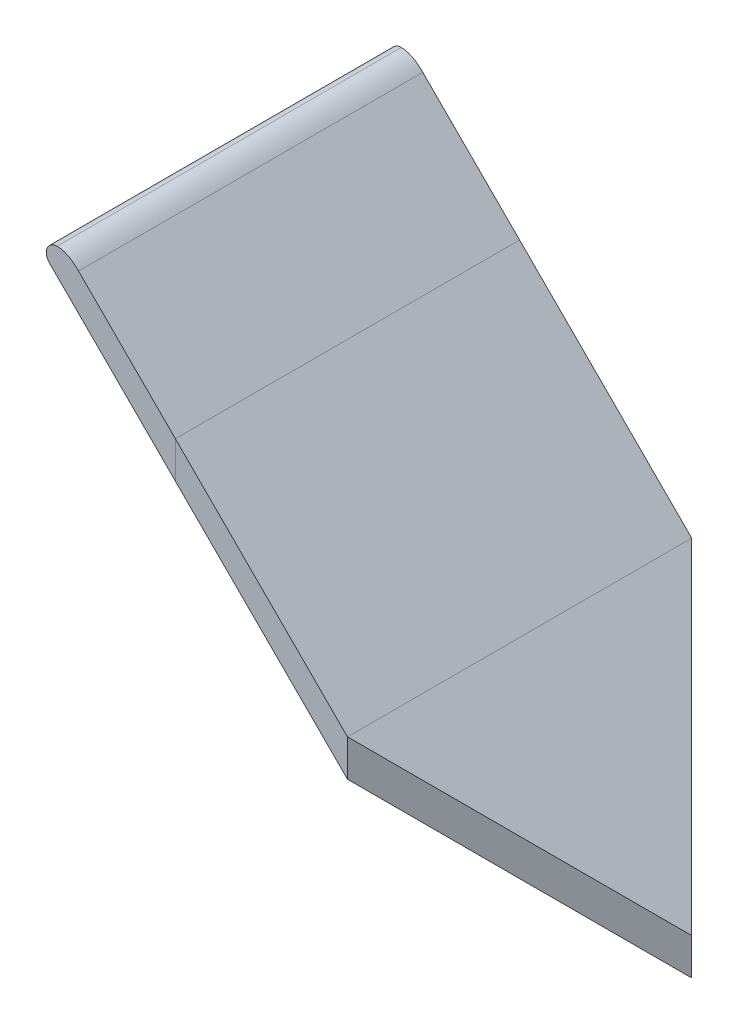
ISO-10303-21;
HEADER;
FILE_DESCRIPTION(('STEP AP214'),'2;1');
FILE_NAME('part.step','',(''),(''),'','','');
FILE_SCHEMA(('AUTOMOTIVE_DESIGN { 1 0 10303 214 1 1 1 1 }'));
ENDSEC;
DATA;
#1=APPLICATION_CONTEXT('core data for automotive mechanical design processes');
#2=APPLICATION_PROTOCOL_DEFINITION('international standard','automotive_design',2000,#1);
#3=PRODUCT_CONTEXT('',#1,'mechanical');
#4=PRODUCT('Part','Part','',(#3));
#5=PRODUCT_RELATED_PRODUCT_CATEGORY('part','',(#4));
#6=PRODUCT_DEFINITION_FORMATION('','',#4);
#7=PRODUCT_DEFINITION_CONTEXT('part definition',#1,'design');
#8=PRODUCT_DEFINITION('design','',#6,#7);
#9=PRODUCT_DEFINITION_SHAPE('','',#8);
#10=(LENGTH_UNIT() NAMED_UNIT(*) SI_UNIT(.MILLI.,.METRE.));
#11=(NAMED_UNIT(*) PLANE_ANGLE_UNIT() SI_UNIT($,.RADIAN.));
#12=(NAMED_UNIT(*) SI_UNIT($,.STERADIAN.) SOLID_ANGLE_UNIT());
#13=UNCERTAINTY_MEASURE_WITH_UNIT(LENGTH_MEASURE(1.E-05),#10,'distance_accuracy_value','');
#14=(GEOMETRIC_REPRESENTATION_CONTEXT(3) GLOBAL_UNCERTAINTY_ASSIGNED_CONTEXT((#13)) GLOBAL_UNIT_ASSIGNED_CONTEXT((#10,
#11,#12)) REPRESENTATION_CONTEXT('',''));
#15=CARTESIAN_POINT('',(0.,0.,0.));
#16=DIRECTION('',(0.,0.,1.));
#17=DIRECTION('',(1.,0.,0.));
#18=AXIS2_PLACEMENT_3D('',#15,#16,#17);
#19=CARTESIAN_POINT('',(-100.,0.,0.));
#20=DIRECTION('',(1.,0.,0.));
#21=DIRECTION('',(0.,0.,-1.));
#22=AXIS2_PLACEMENT_3D('',#19,#20,#21);
#23=PLANE('',#22);
#24=DIRECTION('',(0.,-1.,0.));
#25=VECTOR('',#24,1.);
#26=CARTESIAN_POINT('',(-100.,0.,100.));
#27=LINE('',#26,#25);
#28=CARTESIAN_POINT('',(-100.,-156.250000000004,100.));
#29=VERTEX_POINT('',#28);
#30=CARTESIAN_POINT('',(-100.,-177.588834764832,100.));
#31=VERTEX_POINT('',#30);
#32=EDGE_CURVE('E156',#29,#31,#27,.T.);
#33=ORIENTED_EDGE('',*,*,#32,.F.);
#34=DIRECTION('',(0.,0.,-1.));
#35=VECTOR('',#34,1.);
#36=CARTESIAN_POINT('',(-100.,-156.250000000004,-250.));
#37=LINE('',#36,#35);
#38=CARTESIAN_POINT('',(-100.,-156.250000000004,-99.9999999999999));
#39=VERTEX_POINT('',#38);
#40=EDGE_CURVE('E144',#29,#39,#37,.T.);
#41=ORIENTED_EDGE('',*,*,#40,.T.);
#42=DIRECTION('',(0.,-1.,0.));
#43=VECTOR('',#42,1.);
#44=CARTESIAN_POINT('',(-100.,0.,-100.));
#45=LINE('',#44,#43);
#46=CARTESIAN_POINT('',(-100.,-177.588834764832,-99.9999999999999));
#47=VERTEX_POINT('',#46);
#48=EDGE_CURVE('E83',#39,#47,#45,.T.);
#49=ORIENTED_EDGE('',*,*,#48,.T.);
#50=DIRECTION('',(0.,0.,-1.));
#51=VECTOR('',#50,1.);
#52=CARTESIAN_POINT('',(-100.,-177.588834764833,-250.));
#53=LINE('',#52,#51);
#54=EDGE_CURVE('E157',#31,#47,#53,.T.);
#55=ORIENTED_EDGE('',*,*,#54,.F.);
#56=EDGE_LOOP('',(#33,#41,#49,#55));
#57=FACE_BOUND('',#56,.T.);
#58=ADVANCED_FACE('F80',(#57),#23,.F.);
#59=CARTESIAN_POINT('',(-135.258883476484,-135.258883476483,0.));
#60=DIRECTION('',(0.707106781186548,0.707106781186547,0.));
#61=DIRECTION('',(-0.707106781186547,0.707106781186548,0.));
#62=AXIS2_PLACEMENT_3D('',#59,#60,#61);
#63=PLANE('',#62);
#64=DIRECTION('',(0.707106781186547,-0.707106781186548,0.));
#65=VECTOR('',#64,1.);
#66=CARTESIAN_POINT('',(-74.7005095501215,-195.817257402846,-25.));
#67=LINE('',#66,#65);
#68=CARTESIAN_POINT('',(-74.7005095501215,-195.817257402846,-25.));
#69=VERTEX_POINT('',#68);
#70=CARTESIAN_POINT('',(-57.0228400204579,-213.494926932509,-25.));
#71=VERTEX_POINT('',#70);
#72=EDGE_CURVE('E171',#69,#71,#67,.T.);
#73=ORIENTED_EDGE('',*,*,#72,.T.);
#74=DIRECTION('',(0.,0.,1.));
#75=VECTOR('',#74,1.);
#76=CARTESIAN_POINT('',(-57.0228400204579,-213.494926932509,25.0000000000001));
#77=LINE('',#76,#75);
#78=CARTESIAN_POINT('',(-57.0228400204579,-213.494926932509,25.0000000000001));
#79=VERTEX_POINT('',#78);
#80=EDGE_CURVE('E193',#71,#79,#77,.T.);
#81=ORIENTED_EDGE('',*,*,#80,.T.);
#82=DIRECTION('',(-0.707106781186546,0.707106781186549,0.));
#83=VECTOR('',#82,1.);
#84=CARTESIAN_POINT('',(-74.7005095501215,-195.817257402846,25.0000000000001));
#85=LINE('',#84,#83);
#86=CARTESIAN_POINT('',(-74.7005095501215,-195.817257402846,25.0000000000001));
#87=VERTEX_POINT('',#86);
#88=EDGE_CURVE('E191',#79,#87,#85,.T.);
#89=ORIENTED_EDGE('',*,*,#88,.T.);
#90=DIRECTION('',(0.,0.,-1.));
#91=VECTOR('',#90,1.);
#92=CARTESIAN_POINT('',(-74.7005095501215,-195.817257402846,25.0000000000001));
#93=LINE('',#92,#91);
#94=EDGE_CURVE('E181',#87,#69,#93,.T.);
#95=ORIENTED_EDGE('',*,*,#94,.T.);
#96=EDGE_LOOP('',(#73,#81,#89,#95));
#97=FACE_BOUND('',#96,.T.);
#98=ADVANCED_FACE('F197',(#97),#63,.F.);
#99=CARTESIAN_POINT('',(0.,0.,0.));
#100=DIRECTION('',(0.707106781186547,0.,-0.707106781186548));
#101=DIRECTION('',(-0.707106781186548,0.,-0.707106781186547));
#102=AXIS2_PLACEMENT_3D('',#99,#100,#101);
#103=PLANE('',#102);
#104=ORIENTED_EDGE('',*,*,#48,.F.);
#105=DIRECTION('',(-0.577350269189622,0.577350269189634,-0.577350269189622));
#106=VECTOR('',#105,1.);
#107=CARTESIAN_POINT('',(-258.333333333334,2.08333333333316,-258.333333333333));
#108=LINE('',#107,#106);
#109=CARTESIAN_POINT('',(-2.83661982791727E-11,-256.249999999977,2.8421709430404E-11));
#110=VERTEX_POINT('',#109);
#111=EDGE_CURVE('E151',#110,#39,#108,.T.);
#112=ORIENTED_EDGE('',*,*,#111,.F.);
#113=DIRECTION('',(0.,-1.,0.));
#114=VECTOR('',#113,1.);
#115=CARTESIAN_POINT('',(0.,0.,0.));
#116=LINE('',#115,#114);
#117=CARTESIAN_POINT('',(-2.83939538547884E-11,-277.588834764804,2.8421709430404E-11));
#118=VERTEX_POINT('',#117);
#119=EDGE_CURVE('E163',#110,#118,#116,.T.);
#120=ORIENTED_EDGE('',*,*,#119,.T.);
#121=DIRECTION('',(-0.577350269189625,0.577350269189627,-0.577350269189625));
#122=VECTOR('',#121,1.);
#123=CARTESIAN_POINT('',(-29.7440178594283,-247.844816905404,-29.7440178594283));
#124=LINE('',#123,#122);
#125=EDGE_CURVE('E164',#118,#47,#124,.T.);
#126=ORIENTED_EDGE('',*,*,#125,.T.);
#127=EDGE_LOOP('',(#104,#112,#120,#126));
#128=FACE_BOUND('',#127,.T.);
#129=ADVANCED_FACE('F219',(#128),#103,.T.);
#130=CARTESIAN_POINT('',(0.,0.,0.));
#131=DIRECTION('',(-0.707106781186548,0.,-0.707106781186547));
#132=DIRECTION('',(-0.707106781186547,0.,0.707106781186548));
#133=AXIS2_PLACEMENT_3D('',#130,#131,#132);
#134=PLANE('',#133);
#135=DIRECTION('',(-0.577350269189622,0.577350269189634,0.577350269189622));
#136=VECTOR('',#135,1.);
#137=CARTESIAN_POINT('',(-91.6666666666691,-164.583333333335,91.6666666666692));
#138=LINE('',#137,#136);
#139=EDGE_CURVE('E148',#110,#29,#138,.T.);
#140=ORIENTED_EDGE('',*,*,#139,.T.);
#141=ORIENTED_EDGE('',*,*,#32,.T.);
#142=DIRECTION('',(-0.577350269189625,0.577350269189627,0.577350269189625));
#143=VECTOR('',#142,1.);
#144=CARTESIAN_POINT('',(136.922648807238,-414.511483572071,-136.922648807238));
#145=LINE('',#144,#143);
#146=EDGE_CURVE('E167',#118,#31,#145,.T.);
#147=ORIENTED_EDGE('',*,*,#146,.F.);
#148=ORIENTED_EDGE('',*,*,#119,.F.);
#149=EDGE_LOOP('',(#140,#141,#147,#148));
#150=FACE_BOUND('',#149,.T.);
#151=ADVANCED_FACE('F161',(#150),#134,.F.);
#152=CARTESIAN_POINT('',(-262.5,6.24999999999984,-250.));
#153=DIRECTION('',(0.707106781186555,0.70710678118654,0.));
#154=DIRECTION('',(-0.70710678118654,0.707106781186555,0.));
#155=AXIS2_PLACEMENT_3D('',#152,#153,#154);
#156=PLANE('',#155);
#157=ORIENTED_EDGE('',*,*,#40,.F.);
#158=ORIENTED_EDGE('',*,*,#139,.F.);
#159=ORIENTED_EDGE('',*,*,#111,.T.);
#160=EDGE_LOOP('',(#157,#158,#159));
#161=FACE_BOUND('',#160,.T.);
#162=ADVANCED_FACE('F146',(#161),#156,.T.);
#163=CARTESIAN_POINT('',(-74.7005095501215,-195.817257402846,25.0000000000001));
#164=DIRECTION('',(0.,0.,1.));
#165=DIRECTION('',(1.,0.,0.));
#166=AXIS2_PLACEMENT_3D('',#163,#164,#165);
#167=PLANE('',#166);
#168=DIRECTION('',(-0.707106781186546,0.707106781186549,0.));
#169=VECTOR('',#168,1.);
#170=CARTESIAN_POINT('',(-78.2360434560543,-199.352791308778,25.0000000000001));
#171=LINE('',#170,#169);
#172=CARTESIAN_POINT('',(-60.5583739263906,-217.030460838442,25.0000000000001));
#173=VERTEX_POINT('',#172);
#174=CARTESIAN_POINT('',(-78.2360434560543,-199.352791308778,25.0000000000001));
#175=VERTEX_POINT('',#174);
#176=EDGE_CURVE('E186',#173,#175,#171,.T.);
#177=ORIENTED_EDGE('',*,*,#176,.T.);
#178=DIRECTION('',(-0.707106781186549,-0.707106781186546,0.));
#179=VECTOR('',#178,1.);
#180=CARTESIAN_POINT('',(-74.7005095501215,-195.817257402846,25.0000000000001));
#181=LINE('',#180,#179);
#182=EDGE_CURVE('E177',#87,#175,#181,.T.);
#183=ORIENTED_EDGE('',*,*,#182,.F.);
#184=ORIENTED_EDGE('',*,*,#88,.F.);
#185=DIRECTION('',(-0.707106781186549,-0.707106781186546,0.));
#186=VECTOR('',#185,1.);
#187=CARTESIAN_POINT('',(-57.0228400204579,-213.494926932509,25.0000000000001));
#188=LINE('',#187,#186);
#189=EDGE_CURVE('E98',#79,#173,#188,.T.);
#190=ORIENTED_EDGE('',*,*,#189,.T.);
#191=EDGE_LOOP('',(#177,#183,#184,#190));
#192=FACE_BOUND('',#191,.T.);
#193=ADVANCED_FACE('F211',(#192),#167,.F.);
#194=CARTESIAN_POINT('',(-74.7005095501215,-195.817257402846,25.0000000000001));
#195=DIRECTION('',(-0.707106781186546,0.707106781186549,0.));
#196=DIRECTION('',(-0.707106781186549,-0.707106781186546,0.));
#197=AXIS2_PLACEMENT_3D('',#194,#195,#196);
#198=PLANE('',#197);
#199=DIRECTION('',(0.,0.,-1.));
#200=VECTOR('',#199,1.);
#201=CARTESIAN_POINT('',(-78.2360434560543,-199.352791308778,25.0000000000001));
#202=LINE('',#201,#200);
#203=CARTESIAN_POINT('',(-78.2360434560543,-199.352791308778,-25.));
#204=VERTEX_POINT('',#203);
#205=EDGE_CURVE('E184',#175,#204,#202,.T.);
#206=ORIENTED_EDGE('',*,*,#205,.T.);
#207=DIRECTION('',(-0.707106781186549,-0.707106781186546,0.));
#208=VECTOR('',#207,1.);
#209=CARTESIAN_POINT('',(-74.7005095501215,-195.817257402846,-25.));
#210=LINE('',#209,#208);
#211=EDGE_CURVE('E120',#69,#204,#210,.T.);
#212=ORIENTED_EDGE('',*,*,#211,.F.);
#213=ORIENTED_EDGE('',*,*,#94,.F.);
#214=ORIENTED_EDGE('',*,*,#182,.T.);
#215=EDGE_LOOP('',(#206,#212,#213,#214));
#216=FACE_BOUND('',#215,.T.);
#217=ADVANCED_FACE('F203',(#216),#198,.F.);
#218=CARTESIAN_POINT('',(-74.7005095501215,-195.817257402846,-25.));
#219=DIRECTION('',(0.,0.,-1.));
#220=DIRECTION('',(-1.,0.,0.));
#221=AXIS2_PLACEMENT_3D('',#218,#219,#220);
#222=PLANE('',#221);
#223=DIRECTION('',(0.707106781186547,-0.707106781186548,0.));
#224=VECTOR('',#223,1.);
#225=CARTESIAN_POINT('',(-78.2360434560543,-199.352791308778,-25.));
#226=LINE('',#225,#224);
#227=CARTESIAN_POINT('',(-60.5583739263906,-217.030460838442,-24.9999999999999));
#228=VERTEX_POINT('',#227);
#229=EDGE_CURVE('E13',#204,#228,#226,.T.);
#230=ORIENTED_EDGE('',*,*,#229,.T.);
#231=DIRECTION('',(-0.707106781186549,-0.707106781186546,0.));
#232=VECTOR('',#231,1.);
#233=CARTESIAN_POINT('',(-57.0228400204579,-213.494926932509,-25.));
#234=LINE('',#233,#232);
#235=EDGE_CURVE('E118',#71,#228,#234,.T.);
#236=ORIENTED_EDGE('',*,*,#235,.F.);
#237=ORIENTED_EDGE('',*,*,#72,.F.);
#238=ORIENTED_EDGE('',*,*,#211,.T.);
#239=EDGE_LOOP('',(#230,#236,#237,#238));
#240=FACE_BOUND('',#239,.T.);
#241=ADVANCED_FACE('F199',(#240),#222,.F.);
#242=CARTESIAN_POINT('',(-57.0228400204579,-213.494926932509,25.0000000000001));
#243=DIRECTION('',(0.707106781186546,-0.707106781186549,0.));
#244=DIRECTION('',(0.707106781186549,0.707106781186546,0.));
#245=AXIS2_PLACEMENT_3D('',#242,#243,#244);
#246=PLANE('',#245);
#247=DIRECTION('',(0.,0.,1.));
#248=VECTOR('',#247,1.);
#249=CARTESIAN_POINT('',(-60.5583739263906,-217.030460838442,25.0000000000001));
#250=LINE('',#249,#248);
#251=EDGE_CURVE('E89',#228,#173,#250,.T.);
#252=ORIENTED_EDGE('',*,*,#251,.T.);
#253=ORIENTED_EDGE('',*,*,#189,.F.);
#254=ORIENTED_EDGE('',*,*,#80,.F.);
#255=ORIENTED_EDGE('',*,*,#235,.T.);
#256=EDGE_LOOP('',(#252,#253,#254,#255));
#257=FACE_BOUND('',#256,.T.);
#258=ADVANCED_FACE('F202',(#257),#246,.F.);
#259=CARTESIAN_POINT('',(80.3839732108572,-357.97280797569,-250.));
#260=DIRECTION('',(0.707106781186549,0.707106781186546,0.));
#261=DIRECTION('',(-0.707106781186546,0.707106781186549,0.));
#262=AXIS2_PLACEMENT_3D('',#259,#260,#261);
#263=PLANE('',#262);
#264=ORIENTED_EDGE('',*,*,#251,.F.);
#265=ORIENTED_EDGE('',*,*,#229,.F.);
#266=ORIENTED_EDGE('',*,*,#205,.F.);
#267=ORIENTED_EDGE('',*,*,#176,.F.);
#268=EDGE_LOOP('',(#264,#265,#266,#267));
#269=FACE_BOUND('',#268,.T.);
#270=ORIENTED_EDGE('',*,*,#146,.T.);
#271=ORIENTED_EDGE('',*,*,#54,.T.);
#272=ORIENTED_EDGE('',*,*,#125,.F.);
#273=EDGE_LOOP('',(#270,#271,#272));
#274=FACE_BOUND('',#273,.T.);
#275=ADVANCED_FACE('F209',(#269,#274),#263,.F.);
#276=CLOSED_SHELL('',(#58,#98,#129,#151,#162,#193,#217,#241,#258,#275));
#277=MANIFOLD_SOLID_BREP('B2_NOT_SHOWN',#276);
#278=CARTESIAN_POINT('',(-200.,0.,0.));
#279=DIRECTION('',(1.,0.,0.));
#280=DIRECTION('',(0.,0.,-1.));
#281=AXIS2_PLACEMENT_3D('',#278,#279,#280);
#282=PLANE('',#281);
#283=DIRECTION('',(0.,1.,0.));
#284=VECTOR('',#283,1.);
#285=CARTESIAN_POINT('',(-200.,0.,100.));
#286=LINE('',#285,#284);
#287=CARTESIAN_POINT('',(-200.,-77.588834764832,100.));
#288=VERTEX_POINT('',#287);
#289=CARTESIAN_POINT('',(-200.,-56.2500000000016,100.));
#290=VERTEX_POINT('',#289);
#291=EDGE_CURVE('E379',#288,#290,#286,.T.);
#292=ORIENTED_EDGE('',*,*,#291,.T.);
#293=DIRECTION('',(0.,0.,-1.));
#294=VECTOR('',#293,1.);
#295=CARTESIAN_POINT('',(-200.,-56.2500000000016,-250.));
#296=LINE('',#295,#294);
#297=CARTESIAN_POINT('',(-200.,-56.2500000000016,-100.000000000023));
#298=VERTEX_POINT('',#297);
#299=EDGE_CURVE('E320',#290,#298,#296,.T.);
#300=ORIENTED_EDGE('',*,*,#299,.T.);
#301=DIRECTION('',(0.,1.,0.));
#302=VECTOR('',#301,1.);
#303=CARTESIAN_POINT('',(-200.,0.,-100.));
#304=LINE('',#303,#302);
#305=CARTESIAN_POINT('',(-200.,-77.5888347648321,-100.000000000023));
#306=VERTEX_POINT('',#305);
#307=EDGE_CURVE('E306',#306,#298,#304,.T.);
#308=ORIENTED_EDGE('',*,*,#307,.F.);
#309=DIRECTION('',(0.,0.,-1.));
#310=VECTOR('',#309,1.);
#311=CARTESIAN_POINT('',(-200.,-77.5888347648322,-250.));
#312=LINE('',#311,#310);
#313=EDGE_CURVE('E328',#288,#306,#312,.T.);
#314=ORIENTED_EDGE('',*,*,#313,.F.);
#315=EDGE_LOOP('',(#292,#300,#308,#314));
#316=FACE_BOUND('',#315,.T.);
#317=ADVANCED_FACE('F302',(#316),#282,.F.);
#318=CARTESIAN_POINT('',(0.,0.,-100.));
#319=DIRECTION('',(0.,0.,1.));
#320=DIRECTION('',(1.,0.,0.));
#321=AXIS2_PLACEMENT_3D('',#318,#319,#320);
#322=PLANE('',#321);
#323=ORIENTED_EDGE('',*,*,#307,.T.);
#324=DIRECTION('',(0.70710678118654,-0.707106781186555,0.));
#325=VECTOR('',#324,1.);
#326=CARTESIAN_POINT('',(-262.5,6.24999999999984,-100.));
#327=LINE('',#326,#325);
#328=CARTESIAN_POINT('',(-100.,-156.250000000004,-99.9999999999999));
#329=VERTEX_POINT('',#328);
#330=EDGE_CURVE('E372',#298,#329,#327,.T.);
#331=ORIENTED_EDGE('',*,*,#330,.T.);
#332=DIRECTION('',(0.,-1.,0.));
#333=VECTOR('',#332,1.);
#334=CARTESIAN_POINT('',(-100.,0.,-100.));
#335=LINE('',#334,#333);
#336=CARTESIAN_POINT('',(-100.,-177.588834764832,-99.9999999999999));
#337=VERTEX_POINT('',#336);
#338=EDGE_CURVE('E358',#329,#337,#335,.T.);
#339=ORIENTED_EDGE('',*,*,#338,.T.);
#340=DIRECTION('',(0.707106781186546,-0.707106781186549,0.));
#341=VECTOR('',#340,1.);
#342=CARTESIAN_POINT('',(80.3839732108572,-357.97280797569,-100.));
#343=LINE('',#342,#341);
#344=EDGE_CURVE('E357',#306,#337,#343,.T.);
#345=ORIENTED_EDGE('',*,*,#344,.F.);
#346=EDGE_LOOP('',(#323,#331,#339,#345));
#347=FACE_BOUND('',#346,.T.);
#348=ADVANCED_FACE('F373',(#347),#322,.F.);
#349=CARTESIAN_POINT('',(0.,0.,100.));
#350=DIRECTION('',(0.,0.,1.));
#351=DIRECTION('',(1.,0.,0.));
#352=AXIS2_PLACEMENT_3D('',#349,#350,#351);
#353=PLANE('',#352);
#354=ORIENTED_EDGE('',*,*,#291,.F.);
#355=DIRECTION('',(0.707106781186546,-0.707106781186549,0.));
#356=VECTOR('',#355,1.);
#357=CARTESIAN_POINT('',(80.3839732108572,-357.97280797569,100.));
#358=LINE('',#357,#356);
#359=CARTESIAN_POINT('',(-100.,-177.588834764832,100.));
#360=VERTEX_POINT('',#359);
#361=EDGE_CURVE('E351',#288,#360,#358,.T.);
#362=ORIENTED_EDGE('',*,*,#361,.T.);
#363=DIRECTION('',(0.,-1.,0.));
#364=VECTOR('',#363,1.);
#365=CARTESIAN_POINT('',(-100.,0.,100.));
#366=LINE('',#365,#364);
#367=CARTESIAN_POINT('',(-100.,-156.250000000004,100.));
#368=VERTEX_POINT('',#367);
#369=EDGE_CURVE('E347',#368,#360,#366,.T.);
#370=ORIENTED_EDGE('',*,*,#369,.F.);
#371=DIRECTION('',(0.70710678118654,-0.707106781186555,0.));
#372=VECTOR('',#371,1.);
#373=CARTESIAN_POINT('',(-262.5,6.24999999999984,100.));
#374=LINE('',#373,#372);
#375=EDGE_CURVE('E312',#290,#368,#374,.T.);
#376=ORIENTED_EDGE('',*,*,#375,.F.);
#377=EDGE_LOOP('',(#354,#362,#370,#376));
#378=FACE_BOUND('',#377,.T.);
#379=ADVANCED_FACE('F350',(#378),#353,.T.);
#380=CARTESIAN_POINT('',(-100.,0.,0.));
#381=DIRECTION('',(1.,0.,0.));
#382=DIRECTION('',(0.,0.,-1.));
#383=AXIS2_PLACEMENT_3D('',#380,#381,#382);
#384=PLANE('',#383);
#385=ORIENTED_EDGE('',*,*,#369,.T.);
#386=DIRECTION('',(0.,0.,-1.));
#387=VECTOR('',#386,1.);
#388=CARTESIAN_POINT('',(-100.,-177.588834764833,-250.));
#389=LINE('',#388,#387);
#390=EDGE_CURVE('E367',#360,#337,#389,.T.);
#391=ORIENTED_EDGE('',*,*,#390,.T.);
#392=ORIENTED_EDGE('',*,*,#338,.F.);
#393=DIRECTION('',(0.,0.,-1.));
#394=VECTOR('',#393,1.);
#395=CARTESIAN_POINT('',(-100.,-156.250000000004,-250.));
#396=LINE('',#395,#394);
#397=EDGE_CURVE('E78',#368,#329,#396,.T.);
#398=ORIENTED_EDGE('',*,*,#397,.F.);
#399=EDGE_LOOP('',(#385,#391,#392,#398));
#400=FACE_BOUND('',#399,.T.);
#401=ADVANCED_FACE('F364',(#400),#384,.T.);
#402=CARTESIAN_POINT('',(-262.5,6.24999999999984,-250.));
#403=DIRECTION('',(0.707106781186555,0.70710678118654,0.));
#404=DIRECTION('',(-0.70710678118654,0.707106781186555,0.));
#405=AXIS2_PLACEMENT_3D('',#402,#403,#404);
#406=PLANE('',#405);
#407=ORIENTED_EDGE('',*,*,#299,.F.);
#408=ORIENTED_EDGE('',*,*,#375,.T.);
#409=ORIENTED_EDGE('',*,*,#397,.T.);
#410=ORIENTED_EDGE('',*,*,#330,.F.);
#411=EDGE_LOOP('',(#407,#408,#409,#410));
#412=FACE_BOUND('',#411,.T.);
#413=ADVANCED_FACE('F361',(#412),#406,.T.);
#414=CARTESIAN_POINT('',(80.3839732108572,-357.97280797569,-250.));
#415=DIRECTION('',(0.707106781186549,0.707106781186546,0.));
#416=DIRECTION('',(-0.707106781186546,0.707106781186549,0.));
#417=AXIS2_PLACEMENT_3D('',#414,#415,#416);
#418=PLANE('',#417);
#419=ORIENTED_EDGE('',*,*,#361,.F.);
#420=ORIENTED_EDGE('',*,*,#313,.T.);
#421=ORIENTED_EDGE('',*,*,#344,.T.);
#422=ORIENTED_EDGE('',*,*,#390,.F.);
#423=EDGE_LOOP('',(#419,#420,#421,#422));
#424=FACE_BOUND('',#423,.T.);
#425=ADVANCED_FACE('F304',(#424),#418,.F.);
#426=CLOSED_SHELL('',(#317,#348,#379,#401,#413,#425));
#427=MANIFOLD_SOLID_BREP('B7_NOT_SHOWN',#426);
#428=CARTESIAN_POINT('',(0.,0.,-100.));
#429=DIRECTION('',(0.,0.,1.));
#430=DIRECTION('',(1.,0.,0.));
#431=AXIS2_PLACEMENT_3D('',#428,#429,#430);
#432=PLANE('',#431);
#433=CARTESIAN_POINT('',(-268.75,0.,-100.));
#434=DIRECTION('',(0.,0.,1.));
#435=DIRECTION('',(1.,0.,0.));
#436=AXIS2_PLACEMENT_3D('',#433,#434,#435);
#437=CIRCLE('',#436,6.25000000000093);
#438=CARTESIAN_POINT('',(-273.169417382416,-4.41941738241589,-100.));
#439=VERTEX_POINT('',#438);
#440=CARTESIAN_POINT('',(-268.75,6.25000000000047,-100.));
#441=VERTEX_POINT('',#440);
#442=EDGE_CURVE('E498',#439,#441,#437,.F.);
#443=ORIENTED_EDGE('',*,*,#442,.T.);
#444=CARTESIAN_POINT('',(-268.75,6.25000000000093,-100.));
#445=CARTESIAN_POINT('',(-263.635709852691,6.25000000000097,-100.));
#446=CARTESIAN_POINT('',(-259.544039229348,3.29403922934057,-100.));
#447=CARTESIAN_POINT('',(-256.250000000008,0.,-100.));
#448=B_SPLINE_CURVE_WITH_KNOTS('',3,(#444,#445,#446,#447),.UNSPECIFIED.,.F.,.F.,(4,4),(0.,1.),.UNSPECIFIED.);
#449=CARTESIAN_POINT('',(-256.250000000008,0.,-100.));
#450=VERTEX_POINT('',#449);
#451=EDGE_CURVE('E496',#450,#441,#448,.F.);
#452=ORIENTED_EDGE('',*,*,#451,.F.);
#453=DIRECTION('',(0.70710678118654,-0.707106781186555,0.));
#454=VECTOR('',#453,1.);
#455=CARTESIAN_POINT('',(-262.5,6.24999999999984,-100.));
#456=LINE('',#455,#454);
#457=CARTESIAN_POINT('',(-200.,-56.2500000000016,-100.000000000023));
#458=VERTEX_POINT('',#457);
#459=EDGE_CURVE('E486',#450,#458,#456,.T.);
#460=ORIENTED_EDGE('',*,*,#459,.T.);
#461=DIRECTION('',(0.,1.,0.));
#462=VECTOR('',#461,1.);
#463=CARTESIAN_POINT('',(-200.,0.,-100.));
#464=LINE('',#463,#462);
#465=CARTESIAN_POINT('',(-200.,-77.5888347648321,-100.000000000023));
#466=VERTEX_POINT('',#465);
#467=EDGE_CURVE('E300',#466,#458,#464,.T.);
#468=ORIENTED_EDGE('',*,*,#467,.F.);
#469=DIRECTION('',(0.707106781186546,-0.707106781186549,0.));
#470=VECTOR('',#469,1.);
#471=CARTESIAN_POINT('',(80.3839732108572,-357.97280797569,-100.));
#472=LINE('',#471,#470);
#473=EDGE_CURVE('E455',#439,#466,#472,.T.);
#474=ORIENTED_EDGE('',*,*,#473,.F.);
#475=EDGE_LOOP('',(#443,#452,#460,#468,#474));
#476=FACE_BOUND('',#475,.T.);
#477=ADVANCED_FACE('F438',(#476),#432,.F.);
#478=CARTESIAN_POINT('',(0.,0.,100.));
#479=DIRECTION('',(0.,0.,1.));
#480=DIRECTION('',(1.,0.,0.));
#481=AXIS2_PLACEMENT_3D('',#478,#479,#480);
#482=PLANE('',#481);
#483=CARTESIAN_POINT('',(-268.75,0.,100.));
#484=DIRECTION('',(0.,0.,1.));
#485=DIRECTION('',(1.,0.,0.));
#486=AXIS2_PLACEMENT_3D('',#483,#484,#485);
#487=CIRCLE('',#486,6.25000000000093);
#488=CARTESIAN_POINT('',(-273.169417382416,-4.41941738241589,100.));
#489=VERTEX_POINT('',#488);
#490=CARTESIAN_POINT('',(-268.75,6.25000000000047,100.));
#491=VERTEX_POINT('',#490);
#492=EDGE_CURVE('E514',#489,#491,#487,.F.);
#493=ORIENTED_EDGE('',*,*,#492,.F.);
#494=DIRECTION('',(0.707106781186546,-0.707106781186549,0.));
#495=VECTOR('',#494,1.);
#496=CARTESIAN_POINT('',(80.3839732108572,-357.97280797569,100.));
#497=LINE('',#496,#495);
#498=CARTESIAN_POINT('',(-200.,-77.588834764832,100.));
#499=VERTEX_POINT('',#498);
#500=EDGE_CURVE('E515',#489,#499,#497,.T.);
#501=ORIENTED_EDGE('',*,*,#500,.T.);
#502=DIRECTION('',(0.,1.,0.));
#503=VECTOR('',#502,1.);
#504=CARTESIAN_POINT('',(-200.,0.,100.));
#505=LINE('',#504,#503);
#506=CARTESIAN_POINT('',(-200.,-56.2500000000016,100.));
#507=VERTEX_POINT('',#506);
#508=EDGE_CURVE('E442',#499,#507,#505,.T.);
#509=ORIENTED_EDGE('',*,*,#508,.T.);
#510=DIRECTION('',(0.70710678118654,-0.707106781186555,0.));
#511=VECTOR('',#510,1.);
#512=CARTESIAN_POINT('',(-262.5,6.24999999999984,100.));
#513=LINE('',#512,#511);
#514=CARTESIAN_POINT('',(-256.250000000008,0.,100.));
#515=VERTEX_POINT('',#514);
#516=EDGE_CURVE('E512',#515,#507,#513,.T.);
#517=ORIENTED_EDGE('',*,*,#516,.F.);
#518=CARTESIAN_POINT('',(-268.75,6.25000000000093,100.));
#519=CARTESIAN_POINT('',(-263.635709852691,6.25000000000097,100.));
#520=CARTESIAN_POINT('',(-259.544039229348,3.29403922934057,100.));
#521=CARTESIAN_POINT('',(-256.250000000008,0.,100.));
#522=B_SPLINE_CURVE_WITH_KNOTS('',3,(#518,#519,#520,#521),.UNSPECIFIED.,.F.,.F.,(4,4),(0.,1.),.UNSPECIFIED.);
#523=EDGE_CURVE('E494',#515,#491,#522,.F.);
#524=ORIENTED_EDGE('',*,*,#523,.T.);
#525=EDGE_LOOP('',(#493,#501,#509,#517,#524));
#526=FACE_BOUND('',#525,.T.);
#527=ADVANCED_FACE('F545',(#526),#482,.T.);
#528=CARTESIAN_POINT('',(-200.,0.,0.));
#529=DIRECTION('',(1.,0.,0.));
#530=DIRECTION('',(0.,0.,-1.));
#531=AXIS2_PLACEMENT_3D('',#528,#529,#530);
#532=PLANE('',#531);
#533=ORIENTED_EDGE('',*,*,#508,.F.);
#534=DIRECTION('',(0.,0.,-1.));
#535=VECTOR('',#534,1.);
#536=CARTESIAN_POINT('',(-200.,-77.5888347648322,-250.));
#537=LINE('',#536,#535);
#538=EDGE_CURVE('E460',#499,#466,#537,.T.);
#539=ORIENTED_EDGE('',*,*,#538,.T.);
#540=ORIENTED_EDGE('',*,*,#467,.T.);
#541=DIRECTION('',(0.,0.,-1.));
#542=VECTOR('',#541,1.);
#543=CARTESIAN_POINT('',(-200.,-56.2500000000016,-250.));
#544=LINE('',#543,#542);
#545=EDGE_CURVE('E492',#507,#458,#544,.T.);
#546=ORIENTED_EDGE('',*,*,#545,.F.);
#547=EDGE_LOOP('',(#533,#539,#540,#546));
#548=FACE_BOUND('',#547,.T.);
#549=ADVANCED_FACE('F548',(#548),#532,.T.);
#550=CARTESIAN_POINT('',(-268.75,0.,-250.));
#551=DIRECTION('',(0.,0.,1.));
#552=DIRECTION('',(1.,0.,0.));
#553=AXIS2_PLACEMENT_3D('',#550,#551,#552);
#554=CYLINDRICAL_SURFACE('',#553,6.25000000000093);
#555=ORIENTED_EDGE('',*,*,#442,.F.);
#556=DIRECTION('',(0.,0.,-1.));
#557=VECTOR('',#556,1.);
#558=CARTESIAN_POINT('',(-273.169417382416,-4.41941738241589,-250.));
#559=LINE('',#558,#557);
#560=EDGE_CURVE('E507',#489,#439,#559,.T.);
#561=ORIENTED_EDGE('',*,*,#560,.F.);
#562=ORIENTED_EDGE('',*,*,#492,.T.);
#563=DIRECTION('',(0.,0.,1.));
#564=VECTOR('',#563,1.);
#565=CARTESIAN_POINT('',(-268.75,6.25000000000047,-250.));
#566=LINE('',#565,#564);
#567=EDGE_CURVE('E505',#441,#491,#566,.T.);
#568=ORIENTED_EDGE('',*,*,#567,.F.);
#569=EDGE_LOOP('',(#555,#561,#562,#568));
#570=FACE_BOUND('',#569,.T.);
#571=ADVANCED_FACE('F539',(#570),#554,.T.);
#572=CARTESIAN_POINT('',(-268.75,6.25000000000093,-250.));
#573=CARTESIAN_POINT('',(-263.635709852691,6.25000000000097,-250.));
#574=CARTESIAN_POINT('',(-259.544039229348,3.29403922934057,-250.));
#575=CARTESIAN_POINT('',(-256.250000000008,0.,-250.));
#576=B_SPLINE_CURVE_WITH_KNOTS('',3,(#572,#573,#574,#575),.UNSPECIFIED.,.F.,.F.,(4,4),(0.,1.),.UNSPECIFIED.);
#577=DIRECTION('',(0.,0.,1.));
#578=VECTOR('',#577,1.);
#579=SURFACE_OF_LINEAR_EXTRUSION('',#576,#578);
#580=DIRECTION('',(0.,0.,1.));
#581=VECTOR('',#580,1.);
#582=CARTESIAN_POINT('',(-256.250000000008,0.,-250.));
#583=LINE('',#582,#581);
#584=EDGE_CURVE('E447',#450,#515,#583,.T.);
#585=ORIENTED_EDGE('',*,*,#584,.F.);
#586=ORIENTED_EDGE('',*,*,#451,.T.);
#587=ORIENTED_EDGE('',*,*,#567,.T.);
#588=ORIENTED_EDGE('',*,*,#523,.F.);
#589=EDGE_LOOP('',(#585,#586,#587,#588));
#590=FACE_BOUND('',#589,.T.);
#591=ADVANCED_FACE('F502',(#590),#579,.F.);
#592=CARTESIAN_POINT('',(-262.5,6.24999999999984,-250.));
#593=DIRECTION('',(0.707106781186555,0.70710678118654,0.));
#594=DIRECTION('',(-0.70710678118654,0.707106781186555,0.));
#595=AXIS2_PLACEMENT_3D('',#592,#593,#594);
#596=PLANE('',#595);
#597=ORIENTED_EDGE('',*,*,#459,.F.);
#598=ORIENTED_EDGE('',*,*,#584,.T.);
#599=ORIENTED_EDGE('',*,*,#516,.T.);
#600=ORIENTED_EDGE('',*,*,#545,.T.);
#601=EDGE_LOOP('',(#597,#598,#599,#600));
#602=FACE_BOUND('',#601,.T.);
#603=ADVANCED_FACE('F488',(#602),#596,.T.);
#604=CARTESIAN_POINT('',(80.3839732108572,-357.97280797569,-250.));
#605=DIRECTION('',(0.707106781186549,0.707106781186546,0.));
#606=DIRECTION('',(-0.707106781186546,0.707106781186549,0.));
#607=AXIS2_PLACEMENT_3D('',#604,#605,#606);
#608=PLANE('',#607);
#609=ORIENTED_EDGE('',*,*,#560,.T.);
#610=ORIENTED_EDGE('',*,*,#473,.T.);
#611=ORIENTED_EDGE('',*,*,#538,.F.);
#612=ORIENTED_EDGE('',*,*,#500,.F.);
#613=EDGE_LOOP('',(#609,#610,#611,#612));
#614=FACE_BOUND('',#613,.T.);
#615=ADVANCED_FACE('F440',(#614),#608,.F.);
#616=CLOSED_SHELL('',(#477,#527,#549,#571,#591,#603,#615));
#617=MANIFOLD_SOLID_BREP('B72',#616);
#618=ADVANCED_BREP_SHAPE_REPRESENTATION('',(#18,#277,#427,#617),#14);
#619=SHAPE_DEFINITION_REPRESENTATION(#9,#618);
ENDSEC;
END-ISO-10303-21;
